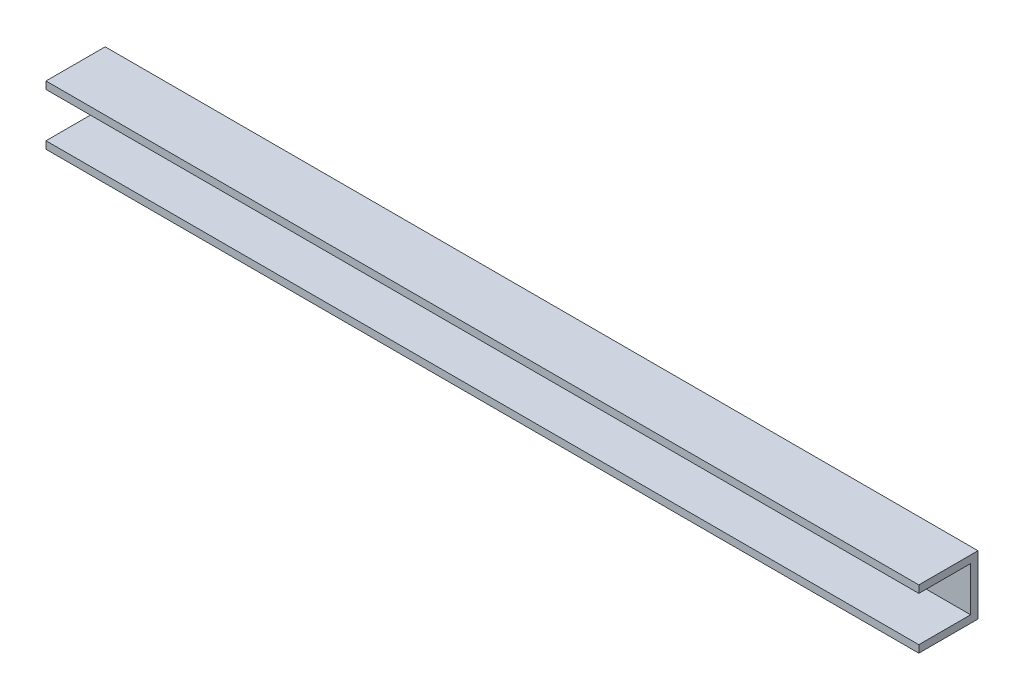
ISO-10303-21;
HEADER;
FILE_DESCRIPTION(('STEP AP214'),'2;1');
FILE_NAME('part.step','',(''),(''),'','','');
FILE_SCHEMA(('AUTOMOTIVE_DESIGN { 1 0 10303 214 1 1 1 1 }'));
ENDSEC;
DATA;
#1=APPLICATION_CONTEXT('core data for automotive mechanical design processes');
#2=APPLICATION_PROTOCOL_DEFINITION('international standard','automotive_design',2000,#1);
#3=PRODUCT_CONTEXT('',#1,'mechanical');
#4=PRODUCT('Part','Part','',(#3));
#5=PRODUCT_RELATED_PRODUCT_CATEGORY('part','',(#4));
#6=PRODUCT_DEFINITION_FORMATION('','',#4);
#7=PRODUCT_DEFINITION_CONTEXT('part definition',#1,'design');
#8=PRODUCT_DEFINITION('design','',#6,#7);
#9=PRODUCT_DEFINITION_SHAPE('','',#8);
#10=(LENGTH_UNIT() NAMED_UNIT(*) SI_UNIT(.MILLI.,.METRE.));
#11=(NAMED_UNIT(*) PLANE_ANGLE_UNIT() SI_UNIT($,.RADIAN.));
#12=(NAMED_UNIT(*) SI_UNIT($,.STERADIAN.) SOLID_ANGLE_UNIT());
#13=UNCERTAINTY_MEASURE_WITH_UNIT(LENGTH_MEASURE(1.E-05),#10,'distance_accuracy_value','');
#14=(GEOMETRIC_REPRESENTATION_CONTEXT(3) GLOBAL_UNCERTAINTY_ASSIGNED_CONTEXT((#13)) GLOBAL_UNIT_ASSIGNED_CONTEXT((#10,
#11,#12)) REPRESENTATION_CONTEXT('',''));
#15=CARTESIAN_POINT('',(0.,0.,0.));
#16=DIRECTION('',(0.,0.,1.));
#17=DIRECTION('',(1.,0.,0.));
#18=AXIS2_PLACEMENT_3D('',#15,#16,#17);
#19=CARTESIAN_POINT('',(374.65,0.,0.));
#20=DIRECTION('',(0.,0.,-1.));
#21=DIRECTION('',(0.,1.,0.));
#22=AXIS2_PLACEMENT_3D('',#19,#20,#21);
#23=PLANE('',#22);
#24=DIRECTION('',(0.,-1.,0.));
#25=VECTOR('',#24,1.);
#26=CARTESIAN_POINT('',(0.,0.,0.));
#27=LINE('',#26,#25);
#28=CARTESIAN_POINT('',(0.,25.4,0.));
#29=VERTEX_POINT('',#28);
#30=CARTESIAN_POINT('',(0.,22.225,0.));
#31=VERTEX_POINT('',#30);
#32=EDGE_CURVE('E126',#29,#31,#27,.T.);
#33=ORIENTED_EDGE('',*,*,#32,.T.);
#34=DIRECTION('',(1.,0.,0.));
#35=VECTOR('',#34,1.);
#36=CARTESIAN_POINT('',(0.,22.225,0.));
#37=LINE('',#36,#35);
#38=CARTESIAN_POINT('',(374.65,22.225,0.));
#39=VERTEX_POINT('',#38);
#40=EDGE_CURVE('E156',#31,#39,#37,.T.);
#41=ORIENTED_EDGE('',*,*,#40,.T.);
#42=DIRECTION('',(0.,-1.,0.));
#43=VECTOR('',#42,1.);
#44=CARTESIAN_POINT('',(374.65,0.,0.));
#45=LINE('',#44,#43);
#46=CARTESIAN_POINT('',(374.65,25.4,0.));
#47=VERTEX_POINT('',#46);
#48=EDGE_CURVE('E157',#47,#39,#45,.T.);
#49=ORIENTED_EDGE('',*,*,#48,.F.);
#50=DIRECTION('',(-1.,0.,0.));
#51=VECTOR('',#50,1.);
#52=CARTESIAN_POINT('',(374.65,25.4,0.));
#53=LINE('',#52,#51);
#54=EDGE_CURVE('E139',#47,#29,#53,.T.);
#55=ORIENTED_EDGE('',*,*,#54,.T.);
#56=EDGE_LOOP('',(#33,#41,#49,#55));
#57=FACE_BOUND('',#56,.T.);
#58=ADVANCED_FACE('F31',(#57),#23,.F.);
#59=CARTESIAN_POINT('',(374.65,3.175,0.));
#60=VERTEX_POINT('',#59);
#61=CARTESIAN_POINT('',(374.65,0.,0.));
#62=VERTEX_POINT('',#61);
#63=EDGE_CURVE('E84',#60,#62,#45,.T.);
#64=ORIENTED_EDGE('',*,*,#63,.F.);
#65=DIRECTION('',(1.,0.,0.));
#66=VECTOR('',#65,1.);
#67=CARTESIAN_POINT('',(0.,3.175,0.));
#68=LINE('',#67,#66);
#69=CARTESIAN_POINT('',(0.,3.175,0.));
#70=VERTEX_POINT('',#69);
#71=EDGE_CURVE('E110',#70,#60,#68,.T.);
#72=ORIENTED_EDGE('',*,*,#71,.F.);
#73=CARTESIAN_POINT('',(0.,0.,0.));
#74=VERTEX_POINT('',#73);
#75=EDGE_CURVE('E118',#70,#74,#27,.T.);
#76=ORIENTED_EDGE('',*,*,#75,.T.);
#77=DIRECTION('',(-1.,0.,0.));
#78=VECTOR('',#77,1.);
#79=CARTESIAN_POINT('',(374.65,0.,0.));
#80=LINE('',#79,#78);
#81=EDGE_CURVE('E11',#62,#74,#80,.T.);
#82=ORIENTED_EDGE('',*,*,#81,.F.);
#83=EDGE_LOOP('',(#64,#72,#76,#82));
#84=FACE_BOUND('',#83,.T.);
#85=ADVANCED_FACE('F33',(#84),#23,.F.);
#86=CARTESIAN_POINT('',(374.65,0.,0.));
#87=DIRECTION('',(0.,1.,0.));
#88=DIRECTION('',(0.,0.,1.));
#89=AXIS2_PLACEMENT_3D('',#86,#87,#88);
#90=PLANE('',#89);
#91=DIRECTION('',(0.,0.,-1.));
#92=VECTOR('',#91,1.);
#93=CARTESIAN_POINT('',(0.,0.,0.));
#94=LINE('',#93,#92);
#95=CARTESIAN_POINT('',(0.,0.,-25.4));
#96=VERTEX_POINT('',#95);
#97=EDGE_CURVE('E125',#74,#96,#94,.T.);
#98=ORIENTED_EDGE('',*,*,#97,.T.);
#99=DIRECTION('',(-1.,0.,0.));
#100=VECTOR('',#99,1.);
#101=CARTESIAN_POINT('',(374.65,0.,-25.4));
#102=LINE('',#101,#100);
#103=CARTESIAN_POINT('',(374.65,0.,-25.4));
#104=VERTEX_POINT('',#103);
#105=EDGE_CURVE('E40',#104,#96,#102,.T.);
#106=ORIENTED_EDGE('',*,*,#105,.F.);
#107=DIRECTION('',(0.,0.,-1.));
#108=VECTOR('',#107,1.);
#109=CARTESIAN_POINT('',(374.65,0.,0.));
#110=LINE('',#109,#108);
#111=EDGE_CURVE('E159',#62,#104,#110,.T.);
#112=ORIENTED_EDGE('',*,*,#111,.F.);
#113=ORIENTED_EDGE('',*,*,#81,.T.);
#114=EDGE_LOOP('',(#98,#106,#112,#113));
#115=FACE_BOUND('',#114,.T.);
#116=ADVANCED_FACE('F195',(#115),#90,.F.);
#117=CARTESIAN_POINT('',(374.65,0.,-25.4));
#118=DIRECTION('',(0.,0.,1.));
#119=DIRECTION('',(0.,-1.,0.));
#120=AXIS2_PLACEMENT_3D('',#117,#118,#119);
#121=PLANE('',#120);
#122=CARTESIAN_POINT('',(187.325,12.7,-25.4));
#123=DIRECTION('',(0.,0.,1.));
#124=DIRECTION('',(1.,0.,0.));
#125=AXIS2_PLACEMENT_3D('',#122,#123,#124);
#126=CIRCLE('',#125,6.35);
#127=CARTESIAN_POINT('',(193.675,12.7,-25.4));
#128=VERTEX_POINT('',#127);
#129=EDGE_CURVE('E127',#128,#128,#126,.T.);
#130=ORIENTED_EDGE('',*,*,#129,.T.);
#131=EDGE_LOOP('',(#130));
#132=FACE_BOUND('',#131,.T.);
#133=DIRECTION('',(0.,1.,0.));
#134=VECTOR('',#133,1.);
#135=CARTESIAN_POINT('',(0.,0.,-25.4));
#136=LINE('',#135,#134);
#137=CARTESIAN_POINT('',(0.,25.4,-25.4));
#138=VERTEX_POINT('',#137);
#139=EDGE_CURVE('E136',#96,#138,#136,.T.);
#140=ORIENTED_EDGE('',*,*,#139,.T.);
#141=DIRECTION('',(-1.,0.,0.));
#142=VECTOR('',#141,1.);
#143=CARTESIAN_POINT('',(374.65,25.4,-25.4));
#144=LINE('',#143,#142);
#145=CARTESIAN_POINT('',(374.65,25.4,-25.4));
#146=VERTEX_POINT('',#145);
#147=EDGE_CURVE('E141',#146,#138,#144,.T.);
#148=ORIENTED_EDGE('',*,*,#147,.F.);
#149=DIRECTION('',(0.,1.,0.));
#150=VECTOR('',#149,1.);
#151=CARTESIAN_POINT('',(374.65,0.,-25.4));
#152=LINE('',#151,#150);
#153=EDGE_CURVE('E149',#104,#146,#152,.T.);
#154=ORIENTED_EDGE('',*,*,#153,.F.);
#155=ORIENTED_EDGE('',*,*,#105,.T.);
#156=EDGE_LOOP('',(#140,#148,#154,#155));
#157=FACE_BOUND('',#156,.T.);
#158=ADVANCED_FACE('F147',(#132,#157),#121,.F.);
#159=CARTESIAN_POINT('',(374.65,25.4,0.));
#160=DIRECTION('',(0.,-1.,0.));
#161=DIRECTION('',(0.,0.,-1.));
#162=AXIS2_PLACEMENT_3D('',#159,#160,#161);
#163=PLANE('',#162);
#164=DIRECTION('',(0.,0.,1.));
#165=VECTOR('',#164,1.);
#166=CARTESIAN_POINT('',(0.,25.4,0.));
#167=LINE('',#166,#165);
#168=EDGE_CURVE('E77',#138,#29,#167,.T.);
#169=ORIENTED_EDGE('',*,*,#168,.T.);
#170=ORIENTED_EDGE('',*,*,#54,.F.);
#171=DIRECTION('',(0.,0.,1.));
#172=VECTOR('',#171,1.);
#173=CARTESIAN_POINT('',(374.65,25.4,0.));
#174=LINE('',#173,#172);
#175=EDGE_CURVE('E56',#146,#47,#174,.T.);
#176=ORIENTED_EDGE('',*,*,#175,.F.);
#177=ORIENTED_EDGE('',*,*,#147,.T.);
#178=EDGE_LOOP('',(#169,#170,#176,#177));
#179=FACE_BOUND('',#178,.T.);
#180=ADVANCED_FACE('F158',(#179),#163,.F.);
#181=CARTESIAN_POINT('',(374.65,25.4,0.));
#182=DIRECTION('',(-1.,0.,0.));
#183=DIRECTION('',(0.,0.,1.));
#184=AXIS2_PLACEMENT_3D('',#181,#182,#183);
#185=PLANE('',#184);
#186=ORIENTED_EDGE('',*,*,#48,.T.);
#187=DIRECTION('',(0.,0.,1.));
#188=VECTOR('',#187,1.);
#189=CARTESIAN_POINT('',(374.65,22.225,0.));
#190=LINE('',#189,#188);
#191=CARTESIAN_POINT('',(374.65,22.225,-22.225));
#192=VERTEX_POINT('',#191);
#193=EDGE_CURVE('E114',#192,#39,#190,.T.);
#194=ORIENTED_EDGE('',*,*,#193,.F.);
#195=DIRECTION('',(0.,1.,0.));
#196=VECTOR('',#195,1.);
#197=CARTESIAN_POINT('',(374.65,22.225,-22.225));
#198=LINE('',#197,#196);
#199=CARTESIAN_POINT('',(374.65,3.175,-22.225));
#200=VERTEX_POINT('',#199);
#201=EDGE_CURVE('E168',#200,#192,#198,.T.);
#202=ORIENTED_EDGE('',*,*,#201,.F.);
#203=DIRECTION('',(0.,0.,-1.));
#204=VECTOR('',#203,1.);
#205=CARTESIAN_POINT('',(374.65,3.175,0.));
#206=LINE('',#205,#204);
#207=EDGE_CURVE('E171',#60,#200,#206,.T.);
#208=ORIENTED_EDGE('',*,*,#207,.F.);
#209=ORIENTED_EDGE('',*,*,#63,.T.);
#210=ORIENTED_EDGE('',*,*,#111,.T.);
#211=ORIENTED_EDGE('',*,*,#153,.T.);
#212=ORIENTED_EDGE('',*,*,#175,.T.);
#213=EDGE_LOOP('',(#186,#194,#202,#208,#209,#210,#211,#212));
#214=FACE_BOUND('',#213,.T.);
#215=ADVANCED_FACE('F176',(#214),#185,.F.);
#216=CARTESIAN_POINT('',(0.,25.4,0.));
#217=DIRECTION('',(-1.,0.,0.));
#218=DIRECTION('',(0.,0.,1.));
#219=AXIS2_PLACEMENT_3D('',#216,#217,#218);
#220=PLANE('',#219);
#221=DIRECTION('',(0.,0.,1.));
#222=VECTOR('',#221,1.);
#223=CARTESIAN_POINT('',(0.,22.225,0.));
#224=LINE('',#223,#222);
#225=CARTESIAN_POINT('',(0.,22.225,-22.225));
#226=VERTEX_POINT('',#225);
#227=EDGE_CURVE('E120',#226,#31,#224,.T.);
#228=ORIENTED_EDGE('',*,*,#227,.T.);
#229=ORIENTED_EDGE('',*,*,#32,.F.);
#230=ORIENTED_EDGE('',*,*,#168,.F.);
#231=ORIENTED_EDGE('',*,*,#139,.F.);
#232=ORIENTED_EDGE('',*,*,#97,.F.);
#233=ORIENTED_EDGE('',*,*,#75,.F.);
#234=DIRECTION('',(0.,0.,-1.));
#235=VECTOR('',#234,1.);
#236=CARTESIAN_POINT('',(0.,3.175,0.));
#237=LINE('',#236,#235);
#238=CARTESIAN_POINT('',(0.,3.175,-22.225));
#239=VERTEX_POINT('',#238);
#240=EDGE_CURVE('E106',#70,#239,#237,.T.);
#241=ORIENTED_EDGE('',*,*,#240,.T.);
#242=DIRECTION('',(0.,1.,0.));
#243=VECTOR('',#242,1.);
#244=CARTESIAN_POINT('',(0.,22.225,-22.225));
#245=LINE('',#244,#243);
#246=EDGE_CURVE('E47',#239,#226,#245,.T.);
#247=ORIENTED_EDGE('',*,*,#246,.T.);
#248=EDGE_LOOP('',(#228,#229,#230,#231,#232,#233,#241,#247));
#249=FACE_BOUND('',#248,.T.);
#250=ADVANCED_FACE('F123',(#249),#220,.T.);
#251=CARTESIAN_POINT('',(187.325,12.7,-25.4));
#252=DIRECTION('',(0.,0.,1.));
#253=DIRECTION('',(1.,0.,0.));
#254=AXIS2_PLACEMENT_3D('',#251,#252,#253);
#255=CYLINDRICAL_SURFACE('',#254,6.35);
#256=CARTESIAN_POINT('',(187.325,12.7,-22.225));
#257=DIRECTION('',(0.,0.,-1.));
#258=DIRECTION('',(0.,1.,0.));
#259=AXIS2_PLACEMENT_3D('',#256,#257,#258);
#260=CIRCLE('',#259,6.35);
#261=CARTESIAN_POINT('',(187.325,19.05,-22.225));
#262=VERTEX_POINT('',#261);
#263=EDGE_CURVE('E35',#262,#262,#260,.F.);
#264=ORIENTED_EDGE('',*,*,#263,.T.);
#265=EDGE_LOOP('',(#264));
#266=FACE_BOUND('',#265,.T.);
#267=ORIENTED_EDGE('',*,*,#129,.F.);
#268=EDGE_LOOP('',(#267));
#269=FACE_BOUND('',#268,.T.);
#270=ADVANCED_FACE('F188',(#266,#269),#255,.F.);
#271=CARTESIAN_POINT('',(0.,22.225,-22.225));
#272=DIRECTION('',(0.,0.,-1.));
#273=DIRECTION('',(0.,1.,0.));
#274=AXIS2_PLACEMENT_3D('',#271,#272,#273);
#275=PLANE('',#274);
#276=ORIENTED_EDGE('',*,*,#201,.T.);
#277=DIRECTION('',(1.,0.,0.));
#278=VECTOR('',#277,1.);
#279=CARTESIAN_POINT('',(0.,22.225,-22.225));
#280=LINE('',#279,#278);
#281=EDGE_CURVE('E164',#226,#192,#280,.T.);
#282=ORIENTED_EDGE('',*,*,#281,.F.);
#283=ORIENTED_EDGE('',*,*,#246,.F.);
#284=DIRECTION('',(1.,0.,0.));
#285=VECTOR('',#284,1.);
#286=CARTESIAN_POINT('',(0.,3.175,-22.225));
#287=LINE('',#286,#285);
#288=EDGE_CURVE('E111',#239,#200,#287,.T.);
#289=ORIENTED_EDGE('',*,*,#288,.T.);
#290=EDGE_LOOP('',(#276,#282,#283,#289));
#291=FACE_BOUND('',#290,.T.);
#292=ORIENTED_EDGE('',*,*,#263,.F.);
#293=EDGE_LOOP('',(#292));
#294=FACE_BOUND('',#293,.T.);
#295=ADVANCED_FACE('F177',(#291,#294),#275,.F.);
#296=CARTESIAN_POINT('',(0.,22.225,0.));
#297=DIRECTION('',(0.,1.,0.));
#298=DIRECTION('',(0.,0.,1.));
#299=AXIS2_PLACEMENT_3D('',#296,#297,#298);
#300=PLANE('',#299);
#301=ORIENTED_EDGE('',*,*,#193,.T.);
#302=ORIENTED_EDGE('',*,*,#40,.F.);
#303=ORIENTED_EDGE('',*,*,#227,.F.);
#304=ORIENTED_EDGE('',*,*,#281,.T.);
#305=EDGE_LOOP('',(#301,#302,#303,#304));
#306=FACE_BOUND('',#305,.T.);
#307=ADVANCED_FACE('F180',(#306),#300,.F.);
#308=CARTESIAN_POINT('',(0.,3.175,0.));
#309=DIRECTION('',(0.,-1.,0.));
#310=DIRECTION('',(0.,0.,-1.));
#311=AXIS2_PLACEMENT_3D('',#308,#309,#310);
#312=PLANE('',#311);
#313=ORIENTED_EDGE('',*,*,#207,.T.);
#314=ORIENTED_EDGE('',*,*,#288,.F.);
#315=ORIENTED_EDGE('',*,*,#240,.F.);
#316=ORIENTED_EDGE('',*,*,#71,.T.);
#317=EDGE_LOOP('',(#313,#314,#315,#316));
#318=FACE_BOUND('',#317,.T.);
#319=ADVANCED_FACE('F109',(#318),#312,.F.);
#320=CLOSED_SHELL('',(#58,#85,#116,#158,#180,#215,#250,#270,#295,#307,#319));
#321=MANIFOLD_SOLID_BREP('B2',#320);
#322=ADVANCED_BREP_SHAPE_REPRESENTATION('',(#18,#321),#14);
#323=SHAPE_DEFINITION_REPRESENTATION(#9,#322);
ENDSEC;
END-ISO-10303-21;
